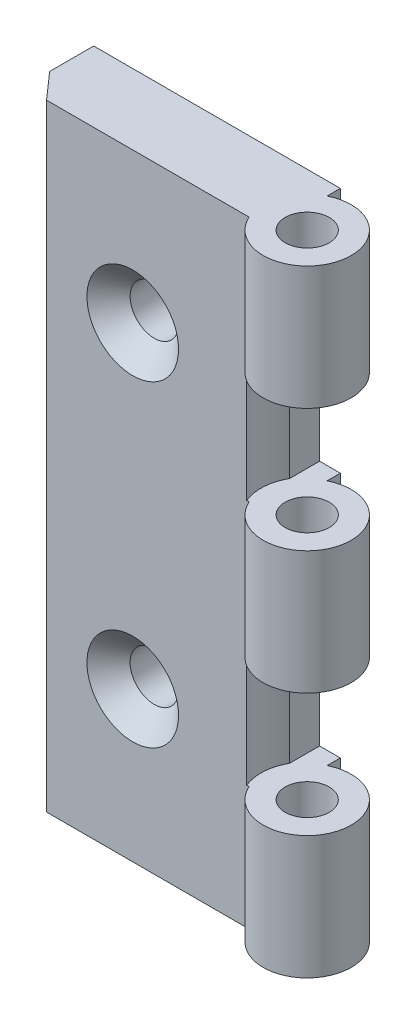
ISO-10303-21;
HEADER;
FILE_DESCRIPTION(('STEP AP214'),'2;1');
FILE_NAME('part.step','',(''),(''),'','','');
FILE_SCHEMA(('AUTOMOTIVE_DESIGN { 1 0 10303 214 1 1 1 1 }'));
ENDSEC;
DATA;
#1=APPLICATION_CONTEXT('core data for automotive mechanical design processes');
#2=APPLICATION_PROTOCOL_DEFINITION('international standard','automotive_design',2000,#1);
#3=PRODUCT_CONTEXT('',#1,'mechanical');
#4=PRODUCT('Part','Part','',(#3));
#5=PRODUCT_RELATED_PRODUCT_CATEGORY('part','',(#4));
#6=PRODUCT_DEFINITION_FORMATION('','',#4);
#7=PRODUCT_DEFINITION_CONTEXT('part definition',#1,'design');
#8=PRODUCT_DEFINITION('design','',#6,#7);
#9=PRODUCT_DEFINITION_SHAPE('','',#8);
#10=(LENGTH_UNIT() NAMED_UNIT(*) SI_UNIT(.MILLI.,.METRE.));
#11=(NAMED_UNIT(*) PLANE_ANGLE_UNIT() SI_UNIT($,.RADIAN.));
#12=(NAMED_UNIT(*) SI_UNIT($,.STERADIAN.) SOLID_ANGLE_UNIT());
#13=UNCERTAINTY_MEASURE_WITH_UNIT(LENGTH_MEASURE(1.E-05),#10,'distance_accuracy_value','');
#14=(GEOMETRIC_REPRESENTATION_CONTEXT(3) GLOBAL_UNCERTAINTY_ASSIGNED_CONTEXT((#13)) GLOBAL_UNIT_ASSIGNED_CONTEXT((#10,
#11,#12)) REPRESENTATION_CONTEXT('',''));
#15=CARTESIAN_POINT('',(0.,0.,0.));
#16=DIRECTION('',(0.,0.,1.));
#17=DIRECTION('',(1.,0.,0.));
#18=AXIS2_PLACEMENT_3D('',#15,#16,#17);
#19=CARTESIAN_POINT('',(2.64575131106459,35.,8.));
#20=DIRECTION('',(0.,0.,-1.));
#21=DIRECTION('',(-1.,0.,0.));
#22=AXIS2_PLACEMENT_3D('',#19,#20,#21);
#23=PLANE('',#22);
#24=CARTESIAN_POINT('',(12.432713766513,18.,8.));
#25=DIRECTION('',(0.,0.,1.));
#26=DIRECTION('',(1.,0.,0.));
#27=AXIS2_PLACEMENT_3D('',#24,#25,#26);
#28=CIRCLE('',#27,5.2);
#29=CARTESIAN_POINT('',(17.632713766513,18.,8.));
#30=VERTEX_POINT('',#29);
#31=EDGE_CURVE('E201',#30,#30,#28,.T.);
#32=ORIENTED_EDGE('',*,*,#31,.F.);
#33=EDGE_LOOP('',(#32));
#34=FACE_BOUND('',#33,.T.);
#35=CARTESIAN_POINT('',(12.432713766513,-18.,8.));
#36=DIRECTION('',(0.,0.,1.));
#37=DIRECTION('',(1.,0.,0.));
#38=AXIS2_PLACEMENT_3D('',#35,#36,#37);
#39=CIRCLE('',#38,5.2);
#40=CARTESIAN_POINT('',(17.632713766513,-18.,8.));
#41=VERTEX_POINT('',#40);
#42=EDGE_CURVE('E207',#41,#41,#39,.T.);
#43=ORIENTED_EDGE('',*,*,#42,.F.);
#44=EDGE_LOOP('',(#43));
#45=FACE_BOUND('',#44,.T.);
#46=DIRECTION('',(-1.,0.,0.));
#47=VECTOR('',#46,1.);
#48=CARTESIAN_POINT('',(2.64575131106459,-7.00000000000001,8.));
#49=LINE('',#48,#47);
#50=CARTESIAN_POINT('',(25.6457513110646,-7.,8.00000000000001));
#51=VERTEX_POINT('',#50);
#52=CARTESIAN_POINT('',(25.3737202697759,-7.,8.));
#53=VERTEX_POINT('',#52);
#54=EDGE_CURVE('E160',#51,#53,#49,.T.);
#55=ORIENTED_EDGE('',*,*,#54,.F.);
#56=DIRECTION('',(0.,-1.,0.));
#57=VECTOR('',#56,1.);
#58=CARTESIAN_POINT('',(25.6457513110646,35.,8.));
#59=LINE('',#58,#57);
#60=CARTESIAN_POINT('',(25.6457513110646,7.,8.));
#61=VERTEX_POINT('',#60);
#62=EDGE_CURVE('E303',#61,#51,#59,.T.);
#63=ORIENTED_EDGE('',*,*,#62,.F.);
#64=DIRECTION('',(1.,0.,0.));
#65=VECTOR('',#64,1.);
#66=CARTESIAN_POINT('',(2.64575131106459,7.,8.));
#67=LINE('',#66,#65);
#68=CARTESIAN_POINT('',(25.3737202697759,7.,8.));
#69=VERTEX_POINT('',#68);
#70=EDGE_CURVE('E192',#69,#61,#67,.T.);
#71=ORIENTED_EDGE('',*,*,#70,.F.);
#72=DIRECTION('',(0.,1.,0.));
#73=VECTOR('',#72,1.);
#74=CARTESIAN_POINT('',(25.3737202697759,-7.84924240491749,8.));
#75=LINE('',#74,#73);
#76=CARTESIAN_POINT('',(25.3737202697759,21.,8.));
#77=VERTEX_POINT('',#76);
#78=EDGE_CURVE('E197',#77,#69,#75,.F.);
#79=ORIENTED_EDGE('',*,*,#78,.F.);
#80=DIRECTION('',(-1.,0.,0.));
#81=VECTOR('',#80,1.);
#82=CARTESIAN_POINT('',(2.64575131106459,21.,8.));
#83=LINE('',#82,#81);
#84=CARTESIAN_POINT('',(25.6457513110646,21.,8.));
#85=VERTEX_POINT('',#84);
#86=EDGE_CURVE('E199',#85,#77,#83,.T.);
#87=ORIENTED_EDGE('',*,*,#86,.F.);
#88=CARTESIAN_POINT('',(25.6457513110646,35.,8.));
#89=VERTEX_POINT('',#88);
#90=EDGE_CURVE('E299',#89,#85,#59,.T.);
#91=ORIENTED_EDGE('',*,*,#90,.F.);
#92=DIRECTION('',(1.,0.,0.));
#93=VECTOR('',#92,1.);
#94=CARTESIAN_POINT('',(2.64575131106459,35.,8.));
#95=LINE('',#94,#93);
#96=CARTESIAN_POINT('',(2.64575131106459,35.,8.));
#97=VERTEX_POINT('',#96);
#98=EDGE_CURVE('E263',#97,#89,#95,.T.);
#99=ORIENTED_EDGE('',*,*,#98,.F.);
#100=DIRECTION('',(0.,-1.,0.));
#101=VECTOR('',#100,1.);
#102=CARTESIAN_POINT('',(2.64575131106459,35.,8.));
#103=LINE('',#102,#101);
#104=CARTESIAN_POINT('',(2.64575131106459,-35.,8.));
#105=VERTEX_POINT('',#104);
#106=EDGE_CURVE('E302',#97,#105,#103,.T.);
#107=ORIENTED_EDGE('',*,*,#106,.T.);
#108=DIRECTION('',(1.,0.,0.));
#109=VECTOR('',#108,1.);
#110=CARTESIAN_POINT('',(2.64575131106459,-35.,8.));
#111=LINE('',#110,#109);
#112=CARTESIAN_POINT('',(25.6457513110646,-35.,8.));
#113=VERTEX_POINT('',#112);
#114=EDGE_CURVE('E276',#105,#113,#111,.T.);
#115=ORIENTED_EDGE('',*,*,#114,.T.);
#116=CARTESIAN_POINT('',(25.6457513110646,-21.,8.));
#117=VERTEX_POINT('',#116);
#118=EDGE_CURVE('E297',#117,#113,#59,.T.);
#119=ORIENTED_EDGE('',*,*,#118,.F.);
#120=DIRECTION('',(1.,0.,0.));
#121=VECTOR('',#120,1.);
#122=CARTESIAN_POINT('',(2.64575131106459,-21.,8.));
#123=LINE('',#122,#121);
#124=CARTESIAN_POINT('',(25.3737202697759,-21.,8.));
#125=VERTEX_POINT('',#124);
#126=EDGE_CURVE('E182',#125,#117,#123,.T.);
#127=ORIENTED_EDGE('',*,*,#126,.F.);
#128=DIRECTION('',(0.,1.,0.));
#129=VECTOR('',#128,1.);
#130=CARTESIAN_POINT('',(25.3737202697759,-35.8492424049175,8.));
#131=LINE('',#130,#129);
#132=EDGE_CURVE('E176',#53,#125,#131,.F.);
#133=ORIENTED_EDGE('',*,*,#132,.F.);
#134=EDGE_LOOP('',(#55,#63,#71,#79,#87,#91,#99,#107,#115,#119,#127,#133));
#135=FACE_BOUND('',#134,.T.);
#136=ADVANCED_FACE('F34',(#34,#45,#135),#23,.F.);
#137=CARTESIAN_POINT('',(25.6457513110646,-7.,10.9802943507832));
#138=DIRECTION('',(1.,0.,0.));
#139=DIRECTION('',(0.,1.,0.));
#140=AXIS2_PLACEMENT_3D('',#137,#138,#139);
#141=PLANE('',#140);
#142=DIRECTION('',(0.,0.,-1.));
#143=VECTOR('',#142,1.);
#144=CARTESIAN_POINT('',(25.6457513110646,-7.,10.9802943507832));
#145=LINE('',#144,#143);
#146=CARTESIAN_POINT('',(25.6457513110646,-7.,3.40314264599775));
#147=VERTEX_POINT('',#146);
#148=CARTESIAN_POINT('',(25.6457513110646,-7.00000000000001,0.));
#149=VERTEX_POINT('',#148);
#150=EDGE_CURVE('E58',#147,#149,#145,.T.);
#151=ORIENTED_EDGE('',*,*,#150,.F.);
#152=DIRECTION('',(0.,1.,0.));
#153=VECTOR('',#152,1.);
#154=CARTESIAN_POINT('',(25.6457513110646,-35.8492424049175,3.40314264599776));
#155=LINE('',#154,#153);
#156=CARTESIAN_POINT('',(25.6457513110646,-21.,3.40314264599776));
#157=VERTEX_POINT('',#156);
#158=EDGE_CURVE('E171',#147,#157,#155,.F.);
#159=ORIENTED_EDGE('',*,*,#158,.T.);
#160=DIRECTION('',(0.,0.,-1.));
#161=VECTOR('',#160,1.);
#162=CARTESIAN_POINT('',(25.6457513110646,-21.,10.9802943507832));
#163=LINE('',#162,#161);
#164=CARTESIAN_POINT('',(25.6457513110646,-21.,0.));
#165=VERTEX_POINT('',#164);
#166=EDGE_CURVE('E216',#157,#165,#163,.T.);
#167=ORIENTED_EDGE('',*,*,#166,.T.);
#168=DIRECTION('',(0.,1.,0.));
#169=VECTOR('',#168,1.);
#170=CARTESIAN_POINT('',(25.6457513110646,35.,0.));
#171=LINE('',#170,#169);
#172=EDGE_CURVE('E43',#165,#149,#171,.T.);
#173=ORIENTED_EDGE('',*,*,#172,.T.);
#174=EDGE_LOOP('',(#151,#159,#167,#173));
#175=FACE_BOUND('',#174,.T.);
#176=ADVANCED_FACE('F343',(#175),#141,.T.);
#177=CARTESIAN_POINT('',(25.6457513110646,21.,10.9802943507832));
#178=DIRECTION('',(1.,0.,0.));
#179=DIRECTION('',(0.,0.,-1.));
#180=AXIS2_PLACEMENT_3D('',#177,#178,#179);
#181=PLANE('',#180);
#182=DIRECTION('',(0.,0.,-1.));
#183=VECTOR('',#182,1.);
#184=CARTESIAN_POINT('',(25.6457513110646,21.,10.9802943507832));
#185=LINE('',#184,#183);
#186=CARTESIAN_POINT('',(25.6457513110646,21.,3.40314264599776));
#187=VERTEX_POINT('',#186);
#188=CARTESIAN_POINT('',(25.6457513110646,21.,0.));
#189=VERTEX_POINT('',#188);
#190=EDGE_CURVE('E51',#187,#189,#185,.T.);
#191=ORIENTED_EDGE('',*,*,#190,.F.);
#192=DIRECTION('',(0.,1.,0.));
#193=VECTOR('',#192,1.);
#194=CARTESIAN_POINT('',(25.6457513110646,-7.84924240491749,3.40314264599776));
#195=LINE('',#194,#193);
#196=CARTESIAN_POINT('',(25.6457513110646,7.,3.40314264599776));
#197=VERTEX_POINT('',#196);
#198=EDGE_CURVE('E194',#187,#197,#195,.F.);
#199=ORIENTED_EDGE('',*,*,#198,.T.);
#200=DIRECTION('',(0.,0.,-1.));
#201=VECTOR('',#200,1.);
#202=CARTESIAN_POINT('',(25.6457513110646,7.,10.9802943507832));
#203=LINE('',#202,#201);
#204=CARTESIAN_POINT('',(25.6457513110646,7.,0.));
#205=VERTEX_POINT('',#204);
#206=EDGE_CURVE('E215',#197,#205,#203,.T.);
#207=ORIENTED_EDGE('',*,*,#206,.T.);
#208=DIRECTION('',(0.,1.,0.));
#209=VECTOR('',#208,1.);
#210=CARTESIAN_POINT('',(25.6457513110646,35.,0.));
#211=LINE('',#210,#209);
#212=EDGE_CURVE('E11',#205,#189,#211,.T.);
#213=ORIENTED_EDGE('',*,*,#212,.T.);
#214=EDGE_LOOP('',(#191,#199,#207,#213));
#215=FACE_BOUND('',#214,.T.);
#216=ADVANCED_FACE('F349',(#215),#181,.T.);
#217=CARTESIAN_POINT('',(30.2196762219613,35.,5.98029435078316));
#218=DIRECTION('',(0.,-1.,0.));
#219=DIRECTION('',(0.,0.,-1.));
#220=AXIS2_PLACEMENT_3D('',#217,#218,#219);
#221=CYLINDRICAL_SURFACE('',#220,5.);
#222=DIRECTION('',(0.,-1.,0.));
#223=VECTOR('',#222,1.);
#224=CARTESIAN_POINT('',(28.,35.,1.5));
#225=LINE('',#224,#223);
#226=CARTESIAN_POINT('',(28.,7.,1.5));
#227=VERTEX_POINT('',#226);
#228=CARTESIAN_POINT('',(28.,-7.00000000000001,1.5));
#229=VERTEX_POINT('',#228);
#230=EDGE_CURVE('E298',#227,#229,#225,.T.);
#231=ORIENTED_EDGE('',*,*,#230,.F.);
#232=CARTESIAN_POINT('',(30.2196762219613,7.,5.98029435078316));
#233=DIRECTION('',(0.,1.,0.));
#234=DIRECTION('',(0.,0.,1.));
#235=AXIS2_PLACEMENT_3D('',#232,#233,#234);
#236=CIRCLE('',#235,5.);
#237=EDGE_CURVE('E248',#61,#227,#236,.T.);
#238=ORIENTED_EDGE('',*,*,#237,.F.);
#239=ORIENTED_EDGE('',*,*,#62,.T.);
#240=CARTESIAN_POINT('',(30.2196762219613,-7.00000000000001,5.98029435078316));
#241=DIRECTION('',(0.,-1.,0.));
#242=DIRECTION('',(0.,0.,-1.));
#243=AXIS2_PLACEMENT_3D('',#240,#241,#242);
#244=CIRCLE('',#243,5.);
#245=EDGE_CURVE('E166',#229,#51,#244,.T.);
#246=ORIENTED_EDGE('',*,*,#245,.F.);
#247=EDGE_LOOP('',(#231,#238,#239,#246));
#248=FACE_BOUND('',#247,.T.);
#249=ADVANCED_FACE('F355',(#248),#221,.T.);
#250=CARTESIAN_POINT('',(30.2196762219613,21.,5.98029435078316));
#251=DIRECTION('',(0.,-1.,0.));
#252=DIRECTION('',(0.,0.,-1.));
#253=AXIS2_PLACEMENT_3D('',#250,#251,#252);
#254=CIRCLE('',#253,5.);
#255=CARTESIAN_POINT('',(28.,21.,1.5));
#256=VERTEX_POINT('',#255);
#257=EDGE_CURVE('E239',#256,#85,#254,.T.);
#258=ORIENTED_EDGE('',*,*,#257,.F.);
#259=CARTESIAN_POINT('',(28.,35.,1.5));
#260=VERTEX_POINT('',#259);
#261=EDGE_CURVE('E294',#260,#256,#225,.T.);
#262=ORIENTED_EDGE('',*,*,#261,.F.);
#263=CARTESIAN_POINT('',(30.2196762219613,35.,5.98029435078316));
#264=DIRECTION('',(0.,1.,0.));
#265=DIRECTION('',(0.,0.,1.));
#266=AXIS2_PLACEMENT_3D('',#263,#264,#265);
#267=CIRCLE('',#266,5.);
#268=EDGE_CURVE('E265',#89,#260,#267,.T.);
#269=ORIENTED_EDGE('',*,*,#268,.F.);
#270=ORIENTED_EDGE('',*,*,#90,.T.);
#271=EDGE_LOOP('',(#258,#262,#269,#270));
#272=FACE_BOUND('',#271,.T.);
#273=ADVANCED_FACE('F413',(#272),#221,.T.);
#274=CARTESIAN_POINT('',(28.,-21.,1.5));
#275=VERTEX_POINT('',#274);
#276=CARTESIAN_POINT('',(28.,-35.,1.5));
#277=VERTEX_POINT('',#276);
#278=EDGE_CURVE('E292',#275,#277,#225,.T.);
#279=ORIENTED_EDGE('',*,*,#278,.F.);
#280=CARTESIAN_POINT('',(30.2196762219613,-21.,5.98029435078316));
#281=DIRECTION('',(0.,1.,0.));
#282=DIRECTION('',(0.,0.,1.));
#283=AXIS2_PLACEMENT_3D('',#280,#281,#282);
#284=CIRCLE('',#283,5.);
#285=EDGE_CURVE('E232',#117,#275,#284,.T.);
#286=ORIENTED_EDGE('',*,*,#285,.F.);
#287=ORIENTED_EDGE('',*,*,#118,.T.);
#288=CARTESIAN_POINT('',(30.2196762219613,-35.,5.98029435078316));
#289=DIRECTION('',(0.,1.,0.));
#290=DIRECTION('',(0.,0.,1.));
#291=AXIS2_PLACEMENT_3D('',#288,#289,#290);
#292=CIRCLE('',#291,5.);
#293=EDGE_CURVE('E279',#113,#277,#292,.T.);
#294=ORIENTED_EDGE('',*,*,#293,.T.);
#295=EDGE_LOOP('',(#279,#286,#287,#294));
#296=FACE_BOUND('',#295,.T.);
#297=ADVANCED_FACE('F382',(#296),#221,.T.);
#298=CARTESIAN_POINT('',(28.,35.,0.));
#299=DIRECTION('',(-1.,0.,0.));
#300=DIRECTION('',(0.,0.,1.));
#301=AXIS2_PLACEMENT_3D('',#298,#299,#300);
#302=PLANE('',#301);
#303=DIRECTION('',(0.,0.,-1.));
#304=VECTOR('',#303,1.);
#305=CARTESIAN_POINT('',(28.,7.,0.));
#306=LINE('',#305,#304);
#307=CARTESIAN_POINT('',(28.,7.,0.));
#308=VERTEX_POINT('',#307);
#309=EDGE_CURVE('E246',#227,#308,#306,.T.);
#310=ORIENTED_EDGE('',*,*,#309,.F.);
#311=ORIENTED_EDGE('',*,*,#230,.T.);
#312=DIRECTION('',(0.,0.,1.));
#313=VECTOR('',#312,1.);
#314=CARTESIAN_POINT('',(28.,-7.00000000000001,0.));
#315=LINE('',#314,#313);
#316=CARTESIAN_POINT('',(28.,-7.00000000000001,0.));
#317=VERTEX_POINT('',#316);
#318=EDGE_CURVE('E223',#317,#229,#315,.T.);
#319=ORIENTED_EDGE('',*,*,#318,.F.);
#320=DIRECTION('',(0.,-1.,0.));
#321=VECTOR('',#320,1.);
#322=CARTESIAN_POINT('',(28.,35.,0.));
#323=LINE('',#322,#321);
#324=EDGE_CURVE('E293',#308,#317,#323,.T.);
#325=ORIENTED_EDGE('',*,*,#324,.F.);
#326=EDGE_LOOP('',(#310,#311,#319,#325));
#327=FACE_BOUND('',#326,.T.);
#328=ADVANCED_FACE('F427',(#327),#302,.F.);
#329=DIRECTION('',(0.,0.,1.));
#330=VECTOR('',#329,1.);
#331=CARTESIAN_POINT('',(28.,21.,0.));
#332=LINE('',#331,#330);
#333=CARTESIAN_POINT('',(28.,21.,0.));
#334=VERTEX_POINT('',#333);
#335=EDGE_CURVE('E237',#334,#256,#332,.T.);
#336=ORIENTED_EDGE('',*,*,#335,.F.);
#337=CARTESIAN_POINT('',(28.,35.,0.));
#338=VERTEX_POINT('',#337);
#339=EDGE_CURVE('E289',#338,#334,#323,.T.);
#340=ORIENTED_EDGE('',*,*,#339,.F.);
#341=DIRECTION('',(0.,0.,-1.));
#342=VECTOR('',#341,1.);
#343=CARTESIAN_POINT('',(28.,35.,0.));
#344=LINE('',#343,#342);
#345=EDGE_CURVE('E267',#260,#338,#344,.T.);
#346=ORIENTED_EDGE('',*,*,#345,.F.);
#347=ORIENTED_EDGE('',*,*,#261,.T.);
#348=EDGE_LOOP('',(#336,#340,#346,#347));
#349=FACE_BOUND('',#348,.T.);
#350=ADVANCED_FACE('F408',(#349),#302,.F.);
#351=DIRECTION('',(0.,0.,-1.));
#352=VECTOR('',#351,1.);
#353=CARTESIAN_POINT('',(28.,-21.,0.));
#354=LINE('',#353,#352);
#355=CARTESIAN_POINT('',(28.,-21.,0.));
#356=VERTEX_POINT('',#355);
#357=EDGE_CURVE('E230',#275,#356,#354,.T.);
#358=ORIENTED_EDGE('',*,*,#357,.F.);
#359=ORIENTED_EDGE('',*,*,#278,.T.);
#360=DIRECTION('',(0.,0.,-1.));
#361=VECTOR('',#360,1.);
#362=CARTESIAN_POINT('',(28.,-35.,0.));
#363=LINE('',#362,#361);
#364=CARTESIAN_POINT('',(28.,-35.,0.));
#365=VERTEX_POINT('',#364);
#366=EDGE_CURVE('E282',#277,#365,#363,.T.);
#367=ORIENTED_EDGE('',*,*,#366,.T.);
#368=EDGE_CURVE('E288',#356,#365,#323,.T.);
#369=ORIENTED_EDGE('',*,*,#368,.F.);
#370=EDGE_LOOP('',(#358,#359,#367,#369));
#371=FACE_BOUND('',#370,.T.);
#372=ADVANCED_FACE('F424',(#371),#302,.F.);
#373=CARTESIAN_POINT('',(0.,35.,0.));
#374=DIRECTION('',(0.,0.,1.));
#375=DIRECTION('',(1.,0.,0.));
#376=AXIS2_PLACEMENT_3D('',#373,#374,#375);
#377=PLANE('',#376);
#378=CARTESIAN_POINT('',(12.432713766513,18.,0.));
#379=DIRECTION('',(0.,0.,1.));
#380=DIRECTION('',(1.,0.,0.));
#381=AXIS2_PLACEMENT_3D('',#378,#379,#380);
#382=CIRCLE('',#381,2.75);
#383=CARTESIAN_POINT('',(15.182713766513,18.,0.));
#384=VERTEX_POINT('',#383);
#385=EDGE_CURVE('E38',#384,#384,#382,.T.);
#386=ORIENTED_EDGE('',*,*,#385,.T.);
#387=EDGE_LOOP('',(#386));
#388=FACE_BOUND('',#387,.T.);
#389=CARTESIAN_POINT('',(12.432713766513,-18.,0.));
#390=DIRECTION('',(0.,0.,1.));
#391=DIRECTION('',(1.,0.,0.));
#392=AXIS2_PLACEMENT_3D('',#389,#390,#391);
#393=CIRCLE('',#392,2.75);
#394=CARTESIAN_POINT('',(15.182713766513,-18.,0.));
#395=VERTEX_POINT('',#394);
#396=EDGE_CURVE('E213',#395,#395,#393,.T.);
#397=ORIENTED_EDGE('',*,*,#396,.T.);
#398=EDGE_LOOP('',(#397));
#399=FACE_BOUND('',#398,.T.);
#400=DIRECTION('',(-1.,0.,0.));
#401=VECTOR('',#400,1.);
#402=CARTESIAN_POINT('',(0.,7.,0.));
#403=LINE('',#402,#401);
#404=EDGE_CURVE('E243',#308,#205,#403,.T.);
#405=ORIENTED_EDGE('',*,*,#404,.F.);
#406=ORIENTED_EDGE('',*,*,#324,.T.);
#407=DIRECTION('',(1.,0.,0.));
#408=VECTOR('',#407,1.);
#409=CARTESIAN_POINT('',(0.,-7.00000000000001,0.));
#410=LINE('',#409,#408);
#411=EDGE_CURVE('E221',#149,#317,#410,.T.);
#412=ORIENTED_EDGE('',*,*,#411,.F.);
#413=ORIENTED_EDGE('',*,*,#172,.F.);
#414=DIRECTION('',(-1.,0.,0.));
#415=VECTOR('',#414,1.);
#416=CARTESIAN_POINT('',(0.,-21.,0.));
#417=LINE('',#416,#415);
#418=EDGE_CURVE('E227',#356,#165,#417,.T.);
#419=ORIENTED_EDGE('',*,*,#418,.F.);
#420=ORIENTED_EDGE('',*,*,#368,.T.);
#421=DIRECTION('',(-1.,0.,0.));
#422=VECTOR('',#421,1.);
#423=CARTESIAN_POINT('',(0.,-35.,0.));
#424=LINE('',#423,#422);
#425=CARTESIAN_POINT('',(0.,-35.,0.));
#426=VERTEX_POINT('',#425);
#427=EDGE_CURVE('E261',#365,#426,#424,.T.);
#428=ORIENTED_EDGE('',*,*,#427,.T.);
#429=DIRECTION('',(0.,-1.,0.));
#430=VECTOR('',#429,1.);
#431=CARTESIAN_POINT('',(0.,35.,0.));
#432=LINE('',#431,#430);
#433=CARTESIAN_POINT('',(0.,35.,0.));
#434=VERTEX_POINT('',#433);
#435=EDGE_CURVE('E271',#434,#426,#432,.T.);
#436=ORIENTED_EDGE('',*,*,#435,.F.);
#437=DIRECTION('',(-1.,0.,0.));
#438=VECTOR('',#437,1.);
#439=CARTESIAN_POINT('',(0.,35.,0.));
#440=LINE('',#439,#438);
#441=EDGE_CURVE('E269',#338,#434,#440,.T.);
#442=ORIENTED_EDGE('',*,*,#441,.F.);
#443=ORIENTED_EDGE('',*,*,#339,.T.);
#444=DIRECTION('',(1.,0.,0.));
#445=VECTOR('',#444,1.);
#446=CARTESIAN_POINT('',(0.,21.,0.));
#447=LINE('',#446,#445);
#448=EDGE_CURVE('E235',#189,#334,#447,.T.);
#449=ORIENTED_EDGE('',*,*,#448,.F.);
#450=ORIENTED_EDGE('',*,*,#212,.F.);
#451=EDGE_LOOP('',(#405,#406,#412,#413,#419,#420,#428,#436,#442,#443,#449,#450));
#452=FACE_BOUND('',#451,.T.);
#453=ADVANCED_FACE('F320',(#388,#399,#452),#377,.F.);
#454=CARTESIAN_POINT('',(30.2196762219613,35.,5.98029435078316));
#455=DIRECTION('',(0.,-1.,0.));
#456=DIRECTION('',(0.,0.,-1.));
#457=AXIS2_PLACEMENT_3D('',#454,#455,#456);
#458=CYLINDRICAL_SURFACE('',#457,2.5);
#459=CARTESIAN_POINT('',(30.2196762219613,35.,5.98029435078316));
#460=DIRECTION('',(0.,1.,0.));
#461=DIRECTION('',(0.,0.,1.));
#462=AXIS2_PLACEMENT_3D('',#459,#460,#461);
#463=CIRCLE('',#462,2.5);
#464=CARTESIAN_POINT('',(30.2196762219613,35.,8.48029435078317));
#465=VERTEX_POINT('',#464);
#466=EDGE_CURVE('E251',#465,#465,#463,.T.);
#467=ORIENTED_EDGE('',*,*,#466,.T.);
#468=EDGE_LOOP('',(#467));
#469=FACE_BOUND('',#468,.T.);
#470=CARTESIAN_POINT('',(30.2196762219613,21.,5.98029435078316));
#471=DIRECTION('',(0.,-1.,0.));
#472=DIRECTION('',(0.,0.,-1.));
#473=AXIS2_PLACEMENT_3D('',#470,#471,#472);
#474=CIRCLE('',#473,2.5);
#475=CARTESIAN_POINT('',(30.2196762219613,21.,3.48029435078316));
#476=VERTEX_POINT('',#475);
#477=EDGE_CURVE('E234',#476,#476,#474,.T.);
#478=ORIENTED_EDGE('',*,*,#477,.T.);
#479=EDGE_LOOP('',(#478));
#480=FACE_BOUND('',#479,.T.);
#481=ADVANCED_FACE('F339',(#469,#480),#458,.F.);
#482=CARTESIAN_POINT('',(30.2196762219613,-35.,5.98029435078316));
#483=DIRECTION('',(0.,1.,0.));
#484=DIRECTION('',(0.,0.,1.));
#485=AXIS2_PLACEMENT_3D('',#482,#483,#484);
#486=CIRCLE('',#485,2.5);
#487=CARTESIAN_POINT('',(30.2196762219613,-35.,8.48029435078317));
#488=VERTEX_POINT('',#487);
#489=EDGE_CURVE('E250',#488,#488,#486,.T.);
#490=ORIENTED_EDGE('',*,*,#489,.F.);
#491=EDGE_LOOP('',(#490));
#492=FACE_BOUND('',#491,.T.);
#493=CARTESIAN_POINT('',(30.2196762219613,-21.,5.98029435078316));
#494=DIRECTION('',(0.,1.,0.));
#495=DIRECTION('',(0.,0.,1.));
#496=AXIS2_PLACEMENT_3D('',#493,#494,#495);
#497=CIRCLE('',#496,2.5);
#498=CARTESIAN_POINT('',(30.2196762219613,-21.,8.48029435078317));
#499=VERTEX_POINT('',#498);
#500=EDGE_CURVE('E226',#499,#499,#497,.T.);
#501=ORIENTED_EDGE('',*,*,#500,.T.);
#502=EDGE_LOOP('',(#501));
#503=FACE_BOUND('',#502,.T.);
#504=ADVANCED_FACE('F340',(#492,#503),#458,.F.);
#505=CARTESIAN_POINT('',(30.2196762219613,35.,5.98029435078316));
#506=DIRECTION('',(0.,1.,0.));
#507=DIRECTION('',(0.,0.,1.));
#508=AXIS2_PLACEMENT_3D('',#505,#506,#507);
#509=PLANE('',#508);
#510=DIRECTION('',(0.,0.,1.));
#511=VECTOR('',#510,1.);
#512=CARTESIAN_POINT('',(0.,35.,0.));
#513=LINE('',#512,#511);
#514=CARTESIAN_POINT('',(0.,35.,5.));
#515=VERTEX_POINT('',#514);
#516=EDGE_CURVE('E257',#434,#515,#513,.T.);
#517=ORIENTED_EDGE('',*,*,#516,.T.);
#518=DIRECTION('',(0.661437827766148,0.,0.75));
#519=VECTOR('',#518,1.);
#520=CARTESIAN_POINT('',(0.,35.,5.));
#521=LINE('',#520,#519);
#522=EDGE_CURVE('E260',#515,#97,#521,.T.);
#523=ORIENTED_EDGE('',*,*,#522,.T.);
#524=ORIENTED_EDGE('',*,*,#98,.T.);
#525=ORIENTED_EDGE('',*,*,#268,.T.);
#526=ORIENTED_EDGE('',*,*,#345,.T.);
#527=ORIENTED_EDGE('',*,*,#441,.T.);
#528=EDGE_LOOP('',(#517,#523,#524,#525,#526,#527));
#529=FACE_BOUND('',#528,.T.);
#530=ORIENTED_EDGE('',*,*,#466,.F.);
#531=EDGE_LOOP('',(#530));
#532=FACE_BOUND('',#531,.T.);
#533=ADVANCED_FACE('F415',(#529,#532),#509,.T.);
#534=CARTESIAN_POINT('',(30.2196762219613,-35.,5.98029435078316));
#535=DIRECTION('',(0.,1.,0.));
#536=DIRECTION('',(0.,0.,1.));
#537=AXIS2_PLACEMENT_3D('',#534,#535,#536);
#538=PLANE('',#537);
#539=DIRECTION('',(0.,0.,1.));
#540=VECTOR('',#539,1.);
#541=CARTESIAN_POINT('',(0.,-35.,0.));
#542=LINE('',#541,#540);
#543=CARTESIAN_POINT('',(0.,-35.,5.));
#544=VERTEX_POINT('',#543);
#545=EDGE_CURVE('E254',#426,#544,#542,.T.);
#546=ORIENTED_EDGE('',*,*,#545,.F.);
#547=ORIENTED_EDGE('',*,*,#427,.F.);
#548=ORIENTED_EDGE('',*,*,#366,.F.);
#549=ORIENTED_EDGE('',*,*,#293,.F.);
#550=ORIENTED_EDGE('',*,*,#114,.F.);
#551=DIRECTION('',(0.661437827766148,0.,0.75));
#552=VECTOR('',#551,1.);
#553=CARTESIAN_POINT('',(0.,-35.,5.));
#554=LINE('',#553,#552);
#555=EDGE_CURVE('E274',#544,#105,#554,.T.);
#556=ORIENTED_EDGE('',*,*,#555,.F.);
#557=EDGE_LOOP('',(#546,#547,#548,#549,#550,#556));
#558=FACE_BOUND('',#557,.T.);
#559=ORIENTED_EDGE('',*,*,#489,.T.);
#560=EDGE_LOOP('',(#559));
#561=FACE_BOUND('',#560,.T.);
#562=ADVANCED_FACE('F367',(#558,#561),#538,.F.);
#563=CARTESIAN_POINT('',(0.,35.,0.));
#564=DIRECTION('',(1.,0.,0.));
#565=DIRECTION('',(0.,0.,-1.));
#566=AXIS2_PLACEMENT_3D('',#563,#564,#565);
#567=PLANE('',#566);
#568=ORIENTED_EDGE('',*,*,#545,.T.);
#569=DIRECTION('',(0.,-1.,0.));
#570=VECTOR('',#569,1.);
#571=CARTESIAN_POINT('',(0.,35.,5.));
#572=LINE('',#571,#570);
#573=EDGE_CURVE('E306',#515,#544,#572,.T.);
#574=ORIENTED_EDGE('',*,*,#573,.F.);
#575=ORIENTED_EDGE('',*,*,#516,.F.);
#576=ORIENTED_EDGE('',*,*,#435,.T.);
#577=EDGE_LOOP('',(#568,#574,#575,#576));
#578=FACE_BOUND('',#577,.T.);
#579=ADVANCED_FACE('F36',(#578),#567,.F.);
#580=CARTESIAN_POINT('',(0.,35.,5.));
#581=DIRECTION('',(0.75,0.,-0.661437827766148));
#582=DIRECTION('',(-0.661437827766148,0.,-0.75));
#583=AXIS2_PLACEMENT_3D('',#580,#581,#582);
#584=PLANE('',#583);
#585=ORIENTED_EDGE('',*,*,#555,.T.);
#586=ORIENTED_EDGE('',*,*,#106,.F.);
#587=ORIENTED_EDGE('',*,*,#522,.F.);
#588=ORIENTED_EDGE('',*,*,#573,.T.);
#589=EDGE_LOOP('',(#585,#586,#587,#588));
#590=FACE_BOUND('',#589,.T.);
#591=ADVANCED_FACE('F357',(#590),#584,.F.);
#592=CARTESIAN_POINT('',(44.7936011328581,-21.,10.9802943507832));
#593=DIRECTION('',(0.,1.,0.));
#594=DIRECTION('',(0.,0.,1.));
#595=AXIS2_PLACEMENT_3D('',#592,#593,#594);
#596=PLANE('',#595);
#597=ORIENTED_EDGE('',*,*,#166,.F.);
#598=CARTESIAN_POINT('',(30.2196762219613,-21.,5.98029435078316));
#599=DIRECTION('',(0.,1.,0.));
#600=DIRECTION('',(0.,0.,1.));
#601=AXIS2_PLACEMENT_3D('',#598,#599,#600);
#602=CIRCLE('',#601,5.25);
#603=EDGE_CURVE('E172',#157,#125,#602,.T.);
#604=ORIENTED_EDGE('',*,*,#603,.T.);
#605=ORIENTED_EDGE('',*,*,#126,.T.);
#606=ORIENTED_EDGE('',*,*,#285,.T.);
#607=ORIENTED_EDGE('',*,*,#357,.T.);
#608=ORIENTED_EDGE('',*,*,#418,.T.);
#609=EDGE_LOOP('',(#597,#604,#605,#606,#607,#608));
#610=FACE_BOUND('',#609,.T.);
#611=ORIENTED_EDGE('',*,*,#500,.F.);
#612=EDGE_LOOP('',(#611));
#613=FACE_BOUND('',#612,.T.);
#614=ADVANCED_FACE('F359',(#610,#613),#596,.T.);
#615=CARTESIAN_POINT('',(44.7936011328581,-7.,10.9802943507832));
#616=DIRECTION('',(0.,-1.,0.));
#617=DIRECTION('',(0.,0.,-1.));
#618=AXIS2_PLACEMENT_3D('',#615,#616,#617);
#619=PLANE('',#618);
#620=ORIENTED_EDGE('',*,*,#318,.T.);
#621=ORIENTED_EDGE('',*,*,#245,.T.);
#622=ORIENTED_EDGE('',*,*,#54,.T.);
#623=CARTESIAN_POINT('',(30.2196762219613,-7.,5.98029435078316));
#624=DIRECTION('',(0.,-1.,0.));
#625=DIRECTION('',(0.,0.,-1.));
#626=AXIS2_PLACEMENT_3D('',#623,#624,#625);
#627=CIRCLE('',#626,5.25);
#628=EDGE_CURVE('E164',#53,#147,#627,.T.);
#629=ORIENTED_EDGE('',*,*,#628,.T.);
#630=ORIENTED_EDGE('',*,*,#150,.T.);
#631=ORIENTED_EDGE('',*,*,#411,.T.);
#632=EDGE_LOOP('',(#620,#621,#622,#629,#630,#631));
#633=FACE_BOUND('',#632,.T.);
#634=CARTESIAN_POINT('',(30.2196762219613,-7.00000000000001,5.98029435078316));
#635=DIRECTION('',(0.,-1.,0.));
#636=DIRECTION('',(0.,0.,-1.));
#637=AXIS2_PLACEMENT_3D('',#634,#635,#636);
#638=CIRCLE('',#637,2.5);
#639=CARTESIAN_POINT('',(30.2196762219613,-7.00000000000001,3.48029435078316));
#640=VERTEX_POINT('',#639);
#641=EDGE_CURVE('E218',#640,#640,#638,.T.);
#642=ORIENTED_EDGE('',*,*,#641,.F.);
#643=EDGE_LOOP('',(#642));
#644=FACE_BOUND('',#643,.T.);
#645=ADVANCED_FACE('F162',(#633,#644),#619,.T.);
#646=CARTESIAN_POINT('',(44.7936011328581,7.,10.9802943507832));
#647=DIRECTION('',(0.,1.,0.));
#648=DIRECTION('',(0.,0.,1.));
#649=AXIS2_PLACEMENT_3D('',#646,#647,#648);
#650=PLANE('',#649);
#651=ORIENTED_EDGE('',*,*,#206,.F.);
#652=CARTESIAN_POINT('',(30.2196762219613,7.,5.98029435078316));
#653=DIRECTION('',(0.,1.,0.));
#654=DIRECTION('',(0.,0.,1.));
#655=AXIS2_PLACEMENT_3D('',#652,#653,#654);
#656=CIRCLE('',#655,5.25);
#657=EDGE_CURVE('E189',#197,#69,#656,.T.);
#658=ORIENTED_EDGE('',*,*,#657,.T.);
#659=ORIENTED_EDGE('',*,*,#70,.T.);
#660=ORIENTED_EDGE('',*,*,#237,.T.);
#661=ORIENTED_EDGE('',*,*,#309,.T.);
#662=ORIENTED_EDGE('',*,*,#404,.T.);
#663=EDGE_LOOP('',(#651,#658,#659,#660,#661,#662));
#664=FACE_BOUND('',#663,.T.);
#665=CARTESIAN_POINT('',(30.2196762219613,7.,5.98029435078316));
#666=DIRECTION('',(0.,1.,0.));
#667=DIRECTION('',(0.,0.,1.));
#668=AXIS2_PLACEMENT_3D('',#665,#666,#667);
#669=CIRCLE('',#668,2.5);
#670=CARTESIAN_POINT('',(30.2196762219613,7.,8.48029435078317));
#671=VERTEX_POINT('',#670);
#672=EDGE_CURVE('E242',#671,#671,#669,.T.);
#673=ORIENTED_EDGE('',*,*,#672,.F.);
#674=EDGE_LOOP('',(#673));
#675=FACE_BOUND('',#674,.T.);
#676=ADVANCED_FACE('F392',(#664,#675),#650,.T.);
#677=CARTESIAN_POINT('',(44.7936011328581,21.,10.9802943507832));
#678=DIRECTION('',(0.,-1.,0.));
#679=DIRECTION('',(0.,0.,-1.));
#680=AXIS2_PLACEMENT_3D('',#677,#678,#679);
#681=PLANE('',#680);
#682=ORIENTED_EDGE('',*,*,#335,.T.);
#683=ORIENTED_EDGE('',*,*,#257,.T.);
#684=ORIENTED_EDGE('',*,*,#86,.T.);
#685=CARTESIAN_POINT('',(30.2196762219613,21.,5.98029435078316));
#686=DIRECTION('',(0.,-1.,0.));
#687=DIRECTION('',(0.,0.,-1.));
#688=AXIS2_PLACEMENT_3D('',#685,#686,#687);
#689=CIRCLE('',#688,5.25);
#690=EDGE_CURVE('E184',#77,#187,#689,.T.);
#691=ORIENTED_EDGE('',*,*,#690,.T.);
#692=ORIENTED_EDGE('',*,*,#190,.T.);
#693=ORIENTED_EDGE('',*,*,#448,.T.);
#694=EDGE_LOOP('',(#682,#683,#684,#691,#692,#693));
#695=FACE_BOUND('',#694,.T.);
#696=ORIENTED_EDGE('',*,*,#477,.F.);
#697=EDGE_LOOP('',(#696));
#698=FACE_BOUND('',#697,.T.);
#699=ADVANCED_FACE('F336',(#695,#698),#681,.T.);
#700=ORIENTED_EDGE('',*,*,#641,.T.);
#701=EDGE_LOOP('',(#700));
#702=FACE_BOUND('',#701,.T.);
#703=ORIENTED_EDGE('',*,*,#672,.T.);
#704=EDGE_LOOP('',(#703));
#705=FACE_BOUND('',#704,.T.);
#706=ADVANCED_FACE('F326',(#702,#705),#458,.F.);
#707=CARTESIAN_POINT('',(12.432713766513,-18.,8.));
#708=DIRECTION('',(0.,0.,1.));
#709=DIRECTION('',(1.,0.,0.));
#710=AXIS2_PLACEMENT_3D('',#707,#708,#709);
#711=CYLINDRICAL_SURFACE('',#710,2.75);
#712=CARTESIAN_POINT('',(12.432713766513,-18.,5.55));
#713=DIRECTION('',(0.,0.,1.));
#714=DIRECTION('',(1.,0.,0.));
#715=AXIS2_PLACEMENT_3D('',#712,#713,#714);
#716=CIRCLE('',#715,2.75);
#717=CARTESIAN_POINT('',(15.182713766513,-18.,5.55));
#718=VERTEX_POINT('',#717);
#719=EDGE_CURVE('E210',#718,#718,#716,.T.);
#720=ORIENTED_EDGE('',*,*,#719,.T.);
#721=EDGE_LOOP('',(#720));
#722=FACE_BOUND('',#721,.T.);
#723=ORIENTED_EDGE('',*,*,#396,.F.);
#724=EDGE_LOOP('',(#723));
#725=FACE_BOUND('',#724,.T.);
#726=ADVANCED_FACE('F323',(#722,#725),#711,.F.);
#727=CARTESIAN_POINT('',(12.432713766513,-18.,8.));
#728=DIRECTION('',(0.,0.,1.));
#729=DIRECTION('',(1.,0.,0.));
#730=AXIS2_PLACEMENT_3D('',#727,#728,#729);
#731=CONICAL_SURFACE('',#730,5.2,0.785398163397448);
#732=ORIENTED_EDGE('',*,*,#719,.F.);
#733=EDGE_LOOP('',(#732));
#734=FACE_BOUND('',#733,.T.);
#735=ORIENTED_EDGE('',*,*,#42,.T.);
#736=EDGE_LOOP('',(#735));
#737=FACE_BOUND('',#736,.T.);
#738=ADVANCED_FACE('F325',(#734,#737),#731,.F.);
#739=CARTESIAN_POINT('',(12.432713766513,18.,8.));
#740=DIRECTION('',(0.,0.,1.));
#741=DIRECTION('',(1.,0.,0.));
#742=AXIS2_PLACEMENT_3D('',#739,#740,#741);
#743=CYLINDRICAL_SURFACE('',#742,2.75);
#744=CARTESIAN_POINT('',(12.432713766513,18.,5.55));
#745=DIRECTION('',(0.,0.,1.));
#746=DIRECTION('',(1.,0.,0.));
#747=AXIS2_PLACEMENT_3D('',#744,#745,#746);
#748=CIRCLE('',#747,2.75);
#749=CARTESIAN_POINT('',(15.182713766513,18.,5.55));
#750=VERTEX_POINT('',#749);
#751=EDGE_CURVE('E204',#750,#750,#748,.T.);
#752=ORIENTED_EDGE('',*,*,#751,.T.);
#753=EDGE_LOOP('',(#752));
#754=FACE_BOUND('',#753,.T.);
#755=ORIENTED_EDGE('',*,*,#385,.F.);
#756=EDGE_LOOP('',(#755));
#757=FACE_BOUND('',#756,.T.);
#758=ADVANCED_FACE('F333',(#754,#757),#743,.F.);
#759=CARTESIAN_POINT('',(12.432713766513,18.,8.));
#760=DIRECTION('',(0.,0.,1.));
#761=DIRECTION('',(1.,0.,0.));
#762=AXIS2_PLACEMENT_3D('',#759,#760,#761);
#763=CONICAL_SURFACE('',#762,5.2,0.785398163397448);
#764=ORIENTED_EDGE('',*,*,#751,.F.);
#765=EDGE_LOOP('',(#764));
#766=FACE_BOUND('',#765,.T.);
#767=ORIENTED_EDGE('',*,*,#31,.T.);
#768=EDGE_LOOP('',(#767));
#769=FACE_BOUND('',#768,.T.);
#770=ADVANCED_FACE('F534',(#766,#769),#763,.F.);
#771=CARTESIAN_POINT('',(30.2196762219613,-7.84924240491749,5.98029435078316));
#772=DIRECTION('',(0.,1.,0.));
#773=DIRECTION('',(0.,0.,1.));
#774=AXIS2_PLACEMENT_3D('',#771,#772,#773);
#775=CYLINDRICAL_SURFACE('',#774,5.25);
#776=ORIENTED_EDGE('',*,*,#78,.T.);
#777=ORIENTED_EDGE('',*,*,#657,.F.);
#778=ORIENTED_EDGE('',*,*,#198,.F.);
#779=ORIENTED_EDGE('',*,*,#690,.F.);
#780=EDGE_LOOP('',(#776,#777,#778,#779));
#781=FACE_BOUND('',#780,.T.);
#782=ADVANCED_FACE('F396',(#781),#775,.F.);
#783=CARTESIAN_POINT('',(30.2196762219613,-35.8492424049175,5.98029435078316));
#784=DIRECTION('',(0.,1.,0.));
#785=DIRECTION('',(0.,0.,1.));
#786=AXIS2_PLACEMENT_3D('',#783,#784,#785);
#787=CYLINDRICAL_SURFACE('',#786,5.25);
#788=ORIENTED_EDGE('',*,*,#132,.T.);
#789=ORIENTED_EDGE('',*,*,#603,.F.);
#790=ORIENTED_EDGE('',*,*,#158,.F.);
#791=ORIENTED_EDGE('',*,*,#628,.F.);
#792=EDGE_LOOP('',(#788,#789,#790,#791));
#793=FACE_BOUND('',#792,.T.);
#794=ADVANCED_FACE('F175',(#793),#787,.F.);
#795=CLOSED_SHELL('',(#136,#176,#216,#249,#273,#297,#328,#350,#372,#453,#481,#504,#533,#562,
#579,#591,#614,#645,#676,#699,#706,#726,#738,#758,#770,#782,#794));
#796=MANIFOLD_SOLID_BREP('B2',#795);
#797=ADVANCED_BREP_SHAPE_REPRESENTATION('',(#18,#796),#14);
#798=SHAPE_DEFINITION_REPRESENTATION(#9,#797);
ENDSEC;
END-ISO-10303-21;
